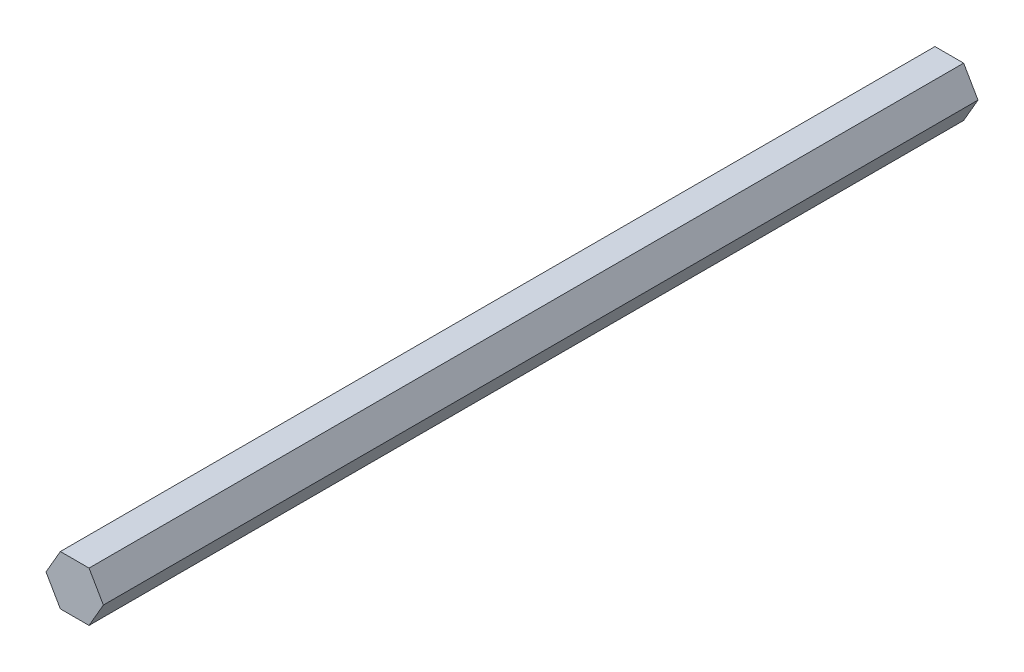
ISO-10303-21;
HEADER;
FILE_DESCRIPTION(('STEP AP214'),'2;1');
FILE_NAME('part.step','',(''),(''),'','','');
FILE_SCHEMA(('AUTOMOTIVE_DESIGN { 1 0 10303 214 1 1 1 1 }'));
ENDSEC;
DATA;
#1=APPLICATION_CONTEXT('core data for automotive mechanical design processes');
#2=APPLICATION_PROTOCOL_DEFINITION('international standard','automotive_design',2000,#1);
#3=PRODUCT_CONTEXT('',#1,'mechanical');
#4=PRODUCT('Part','Part','',(#3));
#5=PRODUCT_RELATED_PRODUCT_CATEGORY('part','',(#4));
#6=PRODUCT_DEFINITION_FORMATION('','',#4);
#7=PRODUCT_DEFINITION_CONTEXT('part definition',#1,'design');
#8=PRODUCT_DEFINITION('design','',#6,#7);
#9=PRODUCT_DEFINITION_SHAPE('','',#8);
#10=(LENGTH_UNIT() NAMED_UNIT(*) SI_UNIT(.MILLI.,.METRE.));
#11=(NAMED_UNIT(*) PLANE_ANGLE_UNIT() SI_UNIT($,.RADIAN.));
#12=(NAMED_UNIT(*) SI_UNIT($,.STERADIAN.) SOLID_ANGLE_UNIT());
#13=UNCERTAINTY_MEASURE_WITH_UNIT(LENGTH_MEASURE(1.E-05),#10,'distance_accuracy_value','');
#14=(GEOMETRIC_REPRESENTATION_CONTEXT(3) GLOBAL_UNCERTAINTY_ASSIGNED_CONTEXT((#13)) GLOBAL_UNIT_ASSIGNED_CONTEXT((#10,
#11,#12)) REPRESENTATION_CONTEXT('',''));
#15=CARTESIAN_POINT('',(0.,0.,0.));
#16=DIRECTION('',(0.,0.,1.));
#17=DIRECTION('',(1.,0.,0.));
#18=AXIS2_PLACEMENT_3D('',#15,#16,#17);
#19=CARTESIAN_POINT('',(-3.6661742093542,6.34999999999996,223.52));
#20=DIRECTION('',(0.866025403784442,-0.499999999999995,0.));
#21=DIRECTION('',(0.499999999999995,0.866025403784442,0.));
#22=AXIS2_PLACEMENT_3D('',#19,#20,#21);
#23=PLANE('',#22);
#24=DIRECTION('',(-0.499999999999995,-0.866025403784441,0.));
#25=VECTOR('',#24,1.);
#26=CARTESIAN_POINT('',(-3.6661742093542,6.34999999999996,0.));
#27=LINE('',#26,#25);
#28=CARTESIAN_POINT('',(-3.6661742093542,6.34999999999996,0.));
#29=VERTEX_POINT('',#28);
#30=CARTESIAN_POINT('',(-7.33234841870825,0.,0.));
#31=VERTEX_POINT('',#30);
#32=EDGE_CURVE('E117',#29,#31,#27,.T.);
#33=ORIENTED_EDGE('',*,*,#32,.T.);
#34=DIRECTION('',(0.,0.,-1.));
#35=VECTOR('',#34,1.);
#36=CARTESIAN_POINT('',(-7.33234841870825,0.,223.52));
#37=LINE('',#36,#35);
#38=CARTESIAN_POINT('',(-7.33234841870825,0.,223.52));
#39=VERTEX_POINT('',#38);
#40=EDGE_CURVE('E11',#39,#31,#37,.T.);
#41=ORIENTED_EDGE('',*,*,#40,.F.);
#42=DIRECTION('',(-0.499999999999995,-0.866025403784441,0.));
#43=VECTOR('',#42,1.);
#44=CARTESIAN_POINT('',(-3.6661742093542,6.34999999999996,223.52));
#45=LINE('',#44,#43);
#46=CARTESIAN_POINT('',(-3.6661742093542,6.34999999999996,223.52));
#47=VERTEX_POINT('',#46);
#48=EDGE_CURVE('E127',#47,#39,#45,.T.);
#49=ORIENTED_EDGE('',*,*,#48,.F.);
#50=DIRECTION('',(0.,0.,-1.));
#51=VECTOR('',#50,1.);
#52=CARTESIAN_POINT('',(-3.6661742093542,6.34999999999996,223.52));
#53=LINE('',#52,#51);
#54=EDGE_CURVE('E113',#47,#29,#53,.T.);
#55=ORIENTED_EDGE('',*,*,#54,.T.);
#56=EDGE_LOOP('',(#33,#41,#49,#55));
#57=FACE_BOUND('',#56,.T.);
#58=ADVANCED_FACE('F33',(#57),#23,.F.);
#59=CARTESIAN_POINT('',(-7.33234841870825,0.,223.52));
#60=DIRECTION('',(0.866025403784438,0.500000000000001,0.));
#61=DIRECTION('',(-0.500000000000001,0.866025403784438,0.));
#62=AXIS2_PLACEMENT_3D('',#59,#60,#61);
#63=PLANE('',#62);
#64=DIRECTION('',(0.500000000000001,-0.866025403784438,0.));
#65=VECTOR('',#64,1.);
#66=CARTESIAN_POINT('',(-7.33234841870825,0.,0.));
#67=LINE('',#66,#65);
#68=CARTESIAN_POINT('',(-3.66617420935411,-6.35000000000001,0.));
#69=VERTEX_POINT('',#68);
#70=EDGE_CURVE('E120',#31,#69,#67,.T.);
#71=ORIENTED_EDGE('',*,*,#70,.T.);
#72=DIRECTION('',(0.,0.,-1.));
#73=VECTOR('',#72,1.);
#74=CARTESIAN_POINT('',(-3.66617420935411,-6.35000000000001,223.52));
#75=LINE('',#74,#73);
#76=CARTESIAN_POINT('',(-3.66617420935411,-6.35000000000001,223.52));
#77=VERTEX_POINT('',#76);
#78=EDGE_CURVE('E41',#77,#69,#75,.T.);
#79=ORIENTED_EDGE('',*,*,#78,.F.);
#80=DIRECTION('',(0.500000000000001,-0.866025403784438,0.));
#81=VECTOR('',#80,1.);
#82=CARTESIAN_POINT('',(-7.33234841870825,0.,223.52));
#83=LINE('',#82,#81);
#84=EDGE_CURVE('E86',#39,#77,#83,.T.);
#85=ORIENTED_EDGE('',*,*,#84,.F.);
#86=ORIENTED_EDGE('',*,*,#40,.T.);
#87=EDGE_LOOP('',(#71,#79,#85,#86));
#88=FACE_BOUND('',#87,.T.);
#89=ADVANCED_FACE('F151',(#88),#63,.F.);
#90=CARTESIAN_POINT('',(-3.66617420935411,-6.35000000000001,223.52));
#91=DIRECTION('',(0.,1.,0.));
#92=DIRECTION('',(-1.,0.,0.));
#93=AXIS2_PLACEMENT_3D('',#90,#91,#92);
#94=PLANE('',#93);
#95=DIRECTION('',(1.,0.,0.));
#96=VECTOR('',#95,1.);
#97=CARTESIAN_POINT('',(-3.66617420935411,-6.35000000000001,0.));
#98=LINE('',#97,#96);
#99=CARTESIAN_POINT('',(3.66617420935416,-6.34999999999999,0.));
#100=VERTEX_POINT('',#99);
#101=EDGE_CURVE('E122',#69,#100,#98,.T.);
#102=ORIENTED_EDGE('',*,*,#101,.T.);
#103=DIRECTION('',(0.,0.,-1.));
#104=VECTOR('',#103,1.);
#105=CARTESIAN_POINT('',(3.66617420935416,-6.34999999999999,223.52));
#106=LINE('',#105,#104);
#107=CARTESIAN_POINT('',(3.66617420935416,-6.34999999999999,223.52));
#108=VERTEX_POINT('',#107);
#109=EDGE_CURVE('E108',#108,#100,#106,.T.);
#110=ORIENTED_EDGE('',*,*,#109,.F.);
#111=DIRECTION('',(1.,0.,0.));
#112=VECTOR('',#111,1.);
#113=CARTESIAN_POINT('',(-3.66617420935411,-6.35000000000001,223.52));
#114=LINE('',#113,#112);
#115=EDGE_CURVE('E99',#77,#108,#114,.T.);
#116=ORIENTED_EDGE('',*,*,#115,.F.);
#117=ORIENTED_EDGE('',*,*,#78,.T.);
#118=EDGE_LOOP('',(#102,#110,#116,#117));
#119=FACE_BOUND('',#118,.T.);
#120=ADVANCED_FACE('F133',(#119),#94,.F.);
#121=CARTESIAN_POINT('',(3.66617420935416,-6.34999999999999,223.52));
#122=DIRECTION('',(-0.866025403784442,0.499999999999995,0.));
#123=DIRECTION('',(-0.499999999999995,-0.866025403784442,0.));
#124=AXIS2_PLACEMENT_3D('',#121,#122,#123);
#125=PLANE('',#124);
#126=DIRECTION('',(0.499999999999995,0.866025403784442,0.));
#127=VECTOR('',#126,1.);
#128=CARTESIAN_POINT('',(3.66617420935416,-6.34999999999999,0.));
#129=LINE('',#128,#127);
#130=CARTESIAN_POINT('',(7.33234841870825,0.,0.));
#131=VERTEX_POINT('',#130);
#132=EDGE_CURVE('E107',#100,#131,#129,.T.);
#133=ORIENTED_EDGE('',*,*,#132,.T.);
#134=DIRECTION('',(0.,0.,-1.));
#135=VECTOR('',#134,1.);
#136=CARTESIAN_POINT('',(7.33234841870825,0.,223.52));
#137=LINE('',#136,#135);
#138=CARTESIAN_POINT('',(7.33234841870825,0.,223.52));
#139=VERTEX_POINT('',#138);
#140=EDGE_CURVE('E104',#139,#131,#137,.T.);
#141=ORIENTED_EDGE('',*,*,#140,.F.);
#142=DIRECTION('',(0.499999999999995,0.866025403784442,0.));
#143=VECTOR('',#142,1.);
#144=CARTESIAN_POINT('',(3.66617420935416,-6.34999999999999,223.52));
#145=LINE('',#144,#143);
#146=EDGE_CURVE('E93',#108,#139,#145,.T.);
#147=ORIENTED_EDGE('',*,*,#146,.F.);
#148=ORIENTED_EDGE('',*,*,#109,.T.);
#149=EDGE_LOOP('',(#133,#141,#147,#148));
#150=FACE_BOUND('',#149,.T.);
#151=ADVANCED_FACE('F105',(#150),#125,.F.);
#152=CARTESIAN_POINT('',(7.33234841870825,0.,223.52));
#153=DIRECTION('',(-0.866025403784435,-0.500000000000007,0.));
#154=DIRECTION('',(0.500000000000007,-0.866025403784435,0.));
#155=AXIS2_PLACEMENT_3D('',#152,#153,#154);
#156=PLANE('',#155);
#157=DIRECTION('',(-0.500000000000007,0.866025403784435,0.));
#158=VECTOR('',#157,1.);
#159=CARTESIAN_POINT('',(7.33234841870825,0.,0.));
#160=LINE('',#159,#158);
#161=CARTESIAN_POINT('',(3.66617420935407,6.35000000000004,0.));
#162=VERTEX_POINT('',#161);
#163=EDGE_CURVE('E72',#131,#162,#160,.T.);
#164=ORIENTED_EDGE('',*,*,#163,.T.);
#165=DIRECTION('',(0.,0.,-1.));
#166=VECTOR('',#165,1.);
#167=CARTESIAN_POINT('',(3.66617420935407,6.35000000000004,223.52));
#168=LINE('',#167,#166);
#169=CARTESIAN_POINT('',(3.66617420935407,6.35000000000004,223.52));
#170=VERTEX_POINT('',#169);
#171=EDGE_CURVE('E109',#170,#162,#168,.T.);
#172=ORIENTED_EDGE('',*,*,#171,.F.);
#173=DIRECTION('',(-0.500000000000007,0.866025403784435,0.));
#174=VECTOR('',#173,1.);
#175=CARTESIAN_POINT('',(7.33234841870825,0.,223.52));
#176=LINE('',#175,#174);
#177=EDGE_CURVE('E97',#139,#170,#176,.T.);
#178=ORIENTED_EDGE('',*,*,#177,.F.);
#179=ORIENTED_EDGE('',*,*,#140,.T.);
#180=EDGE_LOOP('',(#164,#172,#178,#179));
#181=FACE_BOUND('',#180,.T.);
#182=ADVANCED_FACE('F111',(#181),#156,.F.);
#183=CARTESIAN_POINT('',(3.66617420935407,6.35000000000004,223.52));
#184=DIRECTION('',(0.,-1.,0.));
#185=DIRECTION('',(1.,0.,0.));
#186=AXIS2_PLACEMENT_3D('',#183,#184,#185);
#187=PLANE('',#186);
#188=DIRECTION('',(-1.,0.,0.));
#189=VECTOR('',#188,1.);
#190=CARTESIAN_POINT('',(3.66617420935407,6.35000000000004,0.));
#191=LINE('',#190,#189);
#192=EDGE_CURVE('E78',#162,#29,#191,.T.);
#193=ORIENTED_EDGE('',*,*,#192,.T.);
#194=ORIENTED_EDGE('',*,*,#54,.F.);
#195=DIRECTION('',(-1.,0.,0.));
#196=VECTOR('',#195,1.);
#197=CARTESIAN_POINT('',(3.66617420935407,6.35000000000004,223.52));
#198=LINE('',#197,#196);
#199=EDGE_CURVE('E49',#170,#47,#198,.T.);
#200=ORIENTED_EDGE('',*,*,#199,.F.);
#201=ORIENTED_EDGE('',*,*,#171,.T.);
#202=EDGE_LOOP('',(#193,#194,#200,#201));
#203=FACE_BOUND('',#202,.T.);
#204=ADVANCED_FACE('F140',(#203),#187,.F.);
#205=CARTESIAN_POINT('',(0.,0.,223.52));
#206=DIRECTION('',(0.,0.,1.));
#207=DIRECTION('',(1.,0.,0.));
#208=AXIS2_PLACEMENT_3D('',#205,#206,#207);
#209=PLANE('',#208);
#210=ORIENTED_EDGE('',*,*,#48,.T.);
#211=ORIENTED_EDGE('',*,*,#84,.T.);
#212=ORIENTED_EDGE('',*,*,#115,.T.);
#213=ORIENTED_EDGE('',*,*,#146,.T.);
#214=ORIENTED_EDGE('',*,*,#177,.T.);
#215=ORIENTED_EDGE('',*,*,#199,.T.);
#216=EDGE_LOOP('',(#210,#211,#212,#213,#214,#215));
#217=FACE_BOUND('',#216,.T.);
#218=ADVANCED_FACE('F95',(#217),#209,.T.);
#219=CARTESIAN_POINT('',(0.,0.,0.));
#220=DIRECTION('',(0.,0.,1.));
#221=DIRECTION('',(1.,0.,0.));
#222=AXIS2_PLACEMENT_3D('',#219,#220,#221);
#223=PLANE('',#222);
#224=ORIENTED_EDGE('',*,*,#32,.F.);
#225=ORIENTED_EDGE('',*,*,#192,.F.);
#226=ORIENTED_EDGE('',*,*,#163,.F.);
#227=ORIENTED_EDGE('',*,*,#132,.F.);
#228=ORIENTED_EDGE('',*,*,#101,.F.);
#229=ORIENTED_EDGE('',*,*,#70,.F.);
#230=EDGE_LOOP('',(#224,#225,#226,#227,#228,#229));
#231=FACE_BOUND('',#230,.T.);
#232=ADVANCED_FACE('F136',(#231),#223,.F.);
#233=CLOSED_SHELL('',(#58,#89,#120,#151,#182,#204,#218,#232));
#234=MANIFOLD_SOLID_BREP('B2',#233);
#235=ADVANCED_BREP_SHAPE_REPRESENTATION('',(#18,#234),#14);
#236=SHAPE_DEFINITION_REPRESENTATION(#9,#235);
ENDSEC;
END-ISO-10303-21;
